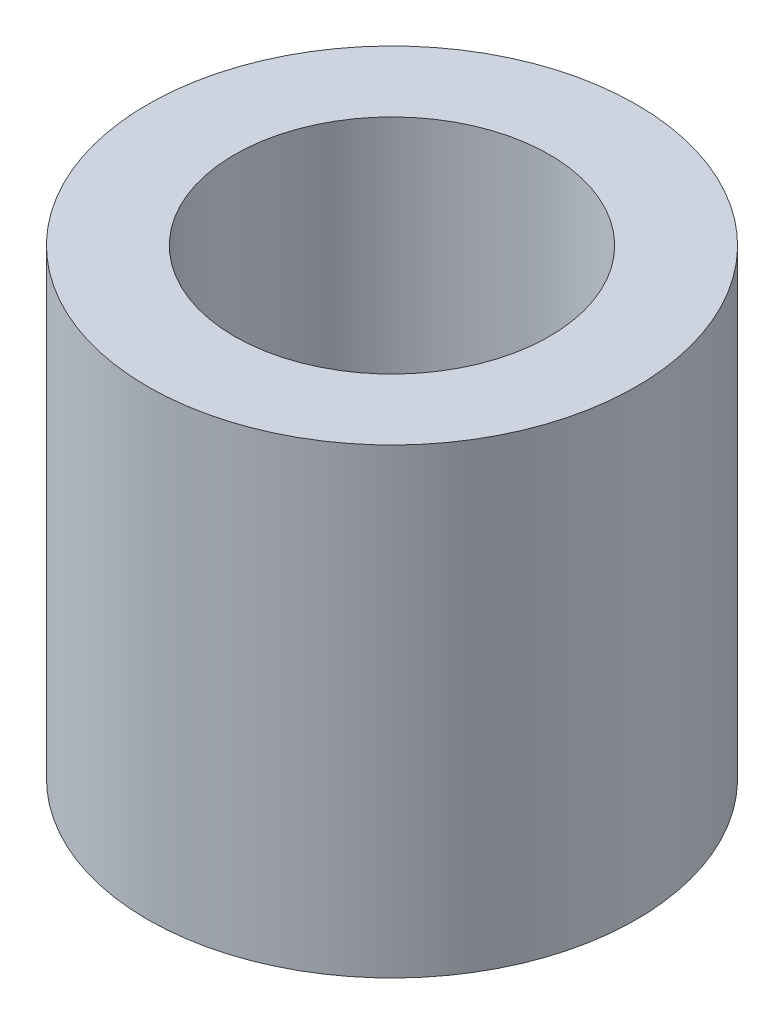
ISO-10303-21;
HEADER;
FILE_DESCRIPTION(('STEP AP214'),'2;1');
FILE_NAME('part.step','',(''),(''),'','','');
FILE_SCHEMA(('AUTOMOTIVE_DESIGN { 1 0 10303 214 1 1 1 1 }'));
ENDSEC;
DATA;
#1=APPLICATION_CONTEXT('core data for automotive mechanical design processes');
#2=APPLICATION_PROTOCOL_DEFINITION('international standard','automotive_design',2000,#1);
#3=PRODUCT_CONTEXT('',#1,'mechanical');
#4=PRODUCT('Part','Part','',(#3));
#5=PRODUCT_RELATED_PRODUCT_CATEGORY('part','',(#4));
#6=PRODUCT_DEFINITION_FORMATION('','',#4);
#7=PRODUCT_DEFINITION_CONTEXT('part definition',#1,'design');
#8=PRODUCT_DEFINITION('design','',#6,#7);
#9=PRODUCT_DEFINITION_SHAPE('','',#8);
#10=(LENGTH_UNIT() NAMED_UNIT(*) SI_UNIT(.MILLI.,.METRE.));
#11=(NAMED_UNIT(*) PLANE_ANGLE_UNIT() SI_UNIT($,.RADIAN.));
#12=(NAMED_UNIT(*) SI_UNIT($,.STERADIAN.) SOLID_ANGLE_UNIT());
#13=UNCERTAINTY_MEASURE_WITH_UNIT(LENGTH_MEASURE(1.E-05),#10,'distance_accuracy_value','');
#14=(GEOMETRIC_REPRESENTATION_CONTEXT(3) GLOBAL_UNCERTAINTY_ASSIGNED_CONTEXT((#13)) GLOBAL_UNIT_ASSIGNED_CONTEXT((#10,
#11,#12)) REPRESENTATION_CONTEXT('',''));
#15=CARTESIAN_POINT('',(0.,0.,0.));
#16=DIRECTION('',(0.,0.,1.));
#17=DIRECTION('',(1.,0.,0.));
#18=AXIS2_PLACEMENT_3D('',#15,#16,#17);
#19=CARTESIAN_POINT('',(0.,4.25,0.));
#20=DIRECTION('',(0.,-1.,0.));
#21=DIRECTION('',(0.,0.,-1.));
#22=AXIS2_PLACEMENT_3D('',#19,#20,#21);
#23=CYLINDRICAL_SURFACE('',#22,2.25);
#24=CARTESIAN_POINT('',(0.,4.25,0.));
#25=DIRECTION('',(0.,1.,0.));
#26=DIRECTION('',(0.,0.,1.));
#27=AXIS2_PLACEMENT_3D('',#24,#25,#26);
#28=CIRCLE('',#27,2.25);
#29=CARTESIAN_POINT('',(0.,4.25,2.25));
#30=VERTEX_POINT('',#29);
#31=EDGE_CURVE('E10',#30,#30,#28,.T.);
#32=ORIENTED_EDGE('',*,*,#31,.F.);
#33=EDGE_LOOP('',(#32));
#34=FACE_BOUND('',#33,.T.);
#35=CARTESIAN_POINT('',(0.,0.,0.));
#36=DIRECTION('',(0.,1.,0.));
#37=DIRECTION('',(0.,0.,1.));
#38=AXIS2_PLACEMENT_3D('',#35,#36,#37);
#39=CIRCLE('',#38,2.25);
#40=CARTESIAN_POINT('',(0.,0.,2.25));
#41=VERTEX_POINT('',#40);
#42=EDGE_CURVE('E42',#41,#41,#39,.T.);
#43=ORIENTED_EDGE('',*,*,#42,.T.);
#44=EDGE_LOOP('',(#43));
#45=FACE_BOUND('',#44,.T.);
#46=ADVANCED_FACE('F39',(#34,#45),#23,.T.);
#47=CARTESIAN_POINT('',(0.,4.25,0.));
#48=DIRECTION('',(0.,1.,0.));
#49=DIRECTION('',(0.,0.,1.));
#50=AXIS2_PLACEMENT_3D('',#47,#48,#49);
#51=PLANE('',#50);
#52=CARTESIAN_POINT('',(0.,4.25,0.));
#53=DIRECTION('',(0.,1.,0.));
#54=DIRECTION('',(0.,0.,1.));
#55=AXIS2_PLACEMENT_3D('',#52,#53,#54);
#56=CIRCLE('',#55,1.45);
#57=CARTESIAN_POINT('',(0.,4.25,1.45));
#58=VERTEX_POINT('',#57);
#59=EDGE_CURVE('E53',#58,#58,#56,.T.);
#60=ORIENTED_EDGE('',*,*,#59,.F.);
#61=EDGE_LOOP('',(#60));
#62=FACE_BOUND('',#61,.T.);
#63=ORIENTED_EDGE('',*,*,#31,.T.);
#64=EDGE_LOOP('',(#63));
#65=FACE_BOUND('',#64,.T.);
#66=ADVANCED_FACE('F59',(#62,#65),#51,.T.);
#67=CARTESIAN_POINT('',(0.,0.,0.));
#68=DIRECTION('',(0.,1.,0.));
#69=DIRECTION('',(0.,0.,1.));
#70=AXIS2_PLACEMENT_3D('',#67,#68,#69);
#71=PLANE('',#70);
#72=CARTESIAN_POINT('',(0.,0.,0.));
#73=DIRECTION('',(0.,1.,0.));
#74=DIRECTION('',(0.,0.,1.));
#75=AXIS2_PLACEMENT_3D('',#72,#73,#74);
#76=CIRCLE('',#75,1.45);
#77=CARTESIAN_POINT('',(0.,0.,1.45));
#78=VERTEX_POINT('',#77);
#79=EDGE_CURVE('E49',#78,#78,#76,.T.);
#80=ORIENTED_EDGE('',*,*,#79,.T.);
#81=EDGE_LOOP('',(#80));
#82=FACE_BOUND('',#81,.T.);
#83=ORIENTED_EDGE('',*,*,#42,.F.);
#84=EDGE_LOOP('',(#83));
#85=FACE_BOUND('',#84,.T.);
#86=ADVANCED_FACE('F61',(#82,#85),#71,.F.);
#87=CARTESIAN_POINT('',(0.,4.25,0.));
#88=DIRECTION('',(0.,1.,0.));
#89=DIRECTION('',(0.,0.,1.));
#90=AXIS2_PLACEMENT_3D('',#87,#88,#89);
#91=CYLINDRICAL_SURFACE('',#90,1.45);
#92=ORIENTED_EDGE('',*,*,#79,.F.);
#93=EDGE_LOOP('',(#92));
#94=FACE_BOUND('',#93,.T.);
#95=ORIENTED_EDGE('',*,*,#59,.T.);
#96=EDGE_LOOP('',(#95));
#97=FACE_BOUND('',#96,.T.);
#98=ADVANCED_FACE('F57',(#94,#97),#91,.F.);
#99=CLOSED_SHELL('',(#46,#66,#86,#98));
#100=MANIFOLD_SOLID_BREP('B2',#99);
#101=ADVANCED_BREP_SHAPE_REPRESENTATION('',(#18,#100),#14);
#102=SHAPE_DEFINITION_REPRESENTATION(#9,#101);
ENDSEC;
END-ISO-10303-21;
